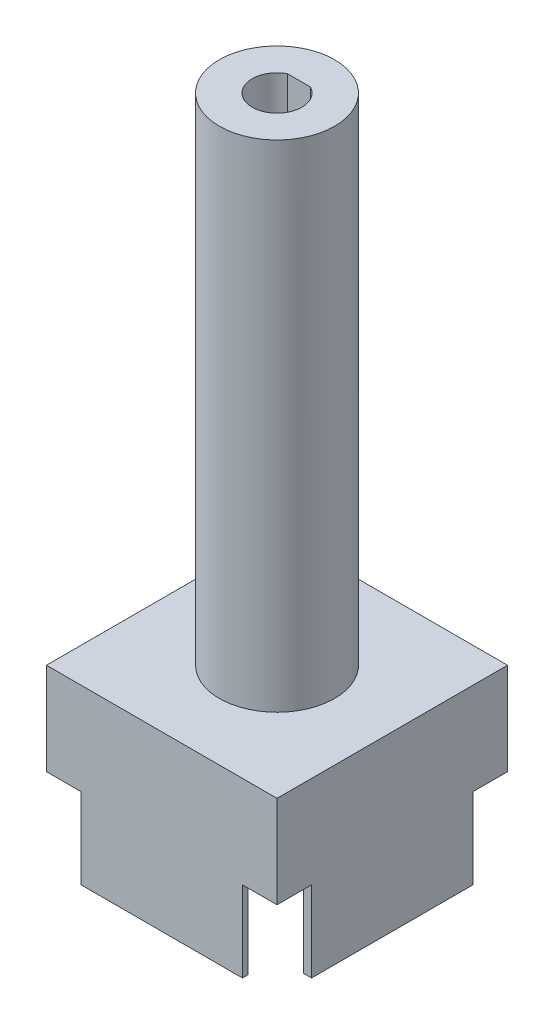
ISO-10303-21;
HEADER;
FILE_DESCRIPTION(('STEP AP214'),'2;1');
FILE_NAME('part.step','',(''),(''),'','','');
FILE_SCHEMA(('AUTOMOTIVE_DESIGN { 1 0 10303 214 1 1 1 1 }'));
ENDSEC;
DATA;
#1=APPLICATION_CONTEXT('core data for automotive mechanical design processes');
#2=APPLICATION_PROTOCOL_DEFINITION('international standard','automotive_design',2000,#1);
#3=PRODUCT_CONTEXT('',#1,'mechanical');
#4=PRODUCT('Part','Part','',(#3));
#5=PRODUCT_RELATED_PRODUCT_CATEGORY('part','',(#4));
#6=PRODUCT_DEFINITION_FORMATION('','',#4);
#7=PRODUCT_DEFINITION_CONTEXT('part definition',#1,'design');
#8=PRODUCT_DEFINITION('design','',#6,#7);
#9=PRODUCT_DEFINITION_SHAPE('','',#8);
#10=(LENGTH_UNIT() NAMED_UNIT(*) SI_UNIT(.MILLI.,.METRE.));
#11=(NAMED_UNIT(*) PLANE_ANGLE_UNIT() SI_UNIT($,.RADIAN.));
#12=(NAMED_UNIT(*) SI_UNIT($,.STERADIAN.) SOLID_ANGLE_UNIT());
#13=UNCERTAINTY_MEASURE_WITH_UNIT(LENGTH_MEASURE(1.E-05),#10,'distance_accuracy_value','');
#14=(GEOMETRIC_REPRESENTATION_CONTEXT(3) GLOBAL_UNCERTAINTY_ASSIGNED_CONTEXT((#13)) GLOBAL_UNIT_ASSIGNED_CONTEXT((#10,
#11,#12)) REPRESENTATION_CONTEXT('',''));
#15=CARTESIAN_POINT('',(0.,0.,0.));
#16=DIRECTION('',(0.,0.,1.));
#17=DIRECTION('',(1.,0.,0.));
#18=AXIS2_PLACEMENT_3D('',#15,#16,#17);
#19=CARTESIAN_POINT('',(0.,0.,0.));
#20=DIRECTION('',(0.,-1.,0.));
#21=DIRECTION('',(0.,0.,-1.));
#22=AXIS2_PLACEMENT_3D('',#19,#20,#21);
#23=PLANE('',#22);
#24=DIRECTION('',(-1.,0.,0.));
#25=VECTOR('',#24,1.);
#26=CARTESIAN_POINT('',(0.,0.,-17.));
#27=LINE('',#26,#25);
#28=CARTESIAN_POINT('',(20.,0.,-17.));
#29=VERTEX_POINT('',#28);
#30=CARTESIAN_POINT('',(19.3,0.,-17.));
#31=VERTEX_POINT('',#30);
#32=EDGE_CURVE('E276',#29,#31,#27,.T.);
#33=ORIENTED_EDGE('',*,*,#32,.F.);
#34=DIRECTION('',(0.,0.,-1.));
#35=VECTOR('',#34,1.);
#36=CARTESIAN_POINT('',(20.,0.,0.));
#37=LINE('',#36,#35);
#38=CARTESIAN_POINT('',(20.,0.,-3.));
#39=VERTEX_POINT('',#38);
#40=EDGE_CURVE('E349',#39,#29,#37,.T.);
#41=ORIENTED_EDGE('',*,*,#40,.F.);
#42=DIRECTION('',(1.,0.,0.));
#43=VECTOR('',#42,1.);
#44=CARTESIAN_POINT('',(0.,0.,-3.));
#45=LINE('',#44,#43);
#46=CARTESIAN_POINT('',(19.3,0.,-3.));
#47=VERTEX_POINT('',#46);
#48=EDGE_CURVE('E264',#47,#39,#45,.T.);
#49=ORIENTED_EDGE('',*,*,#48,.F.);
#50=DIRECTION('',(0.,0.,-1.));
#51=VECTOR('',#50,1.);
#52=CARTESIAN_POINT('',(19.3,0.,-0.5));
#53=LINE('',#52,#51);
#54=EDGE_CURVE('E342',#47,#31,#53,.T.);
#55=ORIENTED_EDGE('',*,*,#54,.T.);
#56=EDGE_LOOP('',(#33,#41,#49,#55));
#57=FACE_BOUND('',#56,.T.);
#58=ADVANCED_FACE('F33',(#57),#23,.T.);
#59=DIRECTION('',(0.,0.,-1.));
#60=VECTOR('',#59,1.);
#61=CARTESIAN_POINT('',(17.,0.,0.));
#62=LINE('',#61,#60);
#63=CARTESIAN_POINT('',(17.,0.,0.));
#64=VERTEX_POINT('',#63);
#65=CARTESIAN_POINT('',(17.,0.,-0.5));
#66=VERTEX_POINT('',#65);
#67=EDGE_CURVE('E268',#64,#66,#62,.T.);
#68=ORIENTED_EDGE('',*,*,#67,.F.);
#69=DIRECTION('',(1.,0.,0.));
#70=VECTOR('',#69,1.);
#71=CARTESIAN_POINT('',(0.,0.,0.));
#72=LINE('',#71,#70);
#73=CARTESIAN_POINT('',(3.,0.,0.));
#74=VERTEX_POINT('',#73);
#75=EDGE_CURVE('E347',#74,#64,#72,.T.);
#76=ORIENTED_EDGE('',*,*,#75,.F.);
#77=DIRECTION('',(0.,0.,1.));
#78=VECTOR('',#77,1.);
#79=CARTESIAN_POINT('',(3.,0.,0.));
#80=LINE('',#79,#78);
#81=CARTESIAN_POINT('',(3.,0.,-0.5));
#82=VERTEX_POINT('',#81);
#83=EDGE_CURVE('E256',#82,#74,#80,.T.);
#84=ORIENTED_EDGE('',*,*,#83,.F.);
#85=DIRECTION('',(1.,0.,0.));
#86=VECTOR('',#85,1.);
#87=CARTESIAN_POINT('',(0.5,0.,-0.5));
#88=LINE('',#87,#86);
#89=EDGE_CURVE('E339',#82,#66,#88,.T.);
#90=ORIENTED_EDGE('',*,*,#89,.T.);
#91=EDGE_LOOP('',(#68,#76,#84,#90));
#92=FACE_BOUND('',#91,.T.);
#93=ADVANCED_FACE('F394',(#92),#23,.T.);
#94=DIRECTION('',(1.,0.,0.));
#95=VECTOR('',#94,1.);
#96=CARTESIAN_POINT('',(0.,0.,-3.));
#97=LINE('',#96,#95);
#98=CARTESIAN_POINT('',(0.,0.,-3.));
#99=VERTEX_POINT('',#98);
#100=CARTESIAN_POINT('',(0.5,0.,-3.));
#101=VERTEX_POINT('',#100);
#102=EDGE_CURVE('E260',#99,#101,#97,.T.);
#103=ORIENTED_EDGE('',*,*,#102,.F.);
#104=DIRECTION('',(0.,0.,1.));
#105=VECTOR('',#104,1.);
#106=CARTESIAN_POINT('',(0.,0.,0.));
#107=LINE('',#106,#105);
#108=CARTESIAN_POINT('',(0.,0.,-17.));
#109=VERTEX_POINT('',#108);
#110=EDGE_CURVE('E336',#109,#99,#107,.T.);
#111=ORIENTED_EDGE('',*,*,#110,.F.);
#112=DIRECTION('',(-1.,0.,0.));
#113=VECTOR('',#112,1.);
#114=CARTESIAN_POINT('',(0.,0.,-17.));
#115=LINE('',#114,#113);
#116=CARTESIAN_POINT('',(0.5,0.,-17.));
#117=VERTEX_POINT('',#116);
#118=EDGE_CURVE('E295',#117,#109,#115,.T.);
#119=ORIENTED_EDGE('',*,*,#118,.F.);
#120=DIRECTION('',(0.,0.,1.));
#121=VECTOR('',#120,1.);
#122=CARTESIAN_POINT('',(0.5,0.,-0.5));
#123=LINE('',#122,#121);
#124=EDGE_CURVE('E324',#117,#101,#123,.T.);
#125=ORIENTED_EDGE('',*,*,#124,.T.);
#126=EDGE_LOOP('',(#103,#111,#119,#125));
#127=FACE_BOUND('',#126,.T.);
#128=ADVANCED_FACE('F370',(#127),#23,.T.);
#129=DIRECTION('',(0.,0.,-1.));
#130=VECTOR('',#129,1.);
#131=CARTESIAN_POINT('',(17.,0.,0.));
#132=LINE('',#131,#130);
#133=CARTESIAN_POINT('',(17.,0.,-19.5));
#134=VERTEX_POINT('',#133);
#135=CARTESIAN_POINT('',(17.,0.,-20.));
#136=VERTEX_POINT('',#135);
#137=EDGE_CURVE('E272',#134,#136,#132,.T.);
#138=ORIENTED_EDGE('',*,*,#137,.F.);
#139=DIRECTION('',(-1.,0.,0.));
#140=VECTOR('',#139,1.);
#141=CARTESIAN_POINT('',(0.5,0.,-19.5));
#142=LINE('',#141,#140);
#143=CARTESIAN_POINT('',(3.,0.,-19.5));
#144=VERTEX_POINT('',#143);
#145=EDGE_CURVE('E329',#134,#144,#142,.T.);
#146=ORIENTED_EDGE('',*,*,#145,.T.);
#147=DIRECTION('',(0.,0.,1.));
#148=VECTOR('',#147,1.);
#149=CARTESIAN_POINT('',(3.,0.,0.));
#150=LINE('',#149,#148);
#151=CARTESIAN_POINT('',(3.,0.,-20.));
#152=VERTEX_POINT('',#151);
#153=EDGE_CURVE('E300',#152,#144,#150,.T.);
#154=ORIENTED_EDGE('',*,*,#153,.F.);
#155=DIRECTION('',(-1.,0.,0.));
#156=VECTOR('',#155,1.);
#157=CARTESIAN_POINT('',(0.,0.,-20.));
#158=LINE('',#157,#156);
#159=EDGE_CURVE('E216',#136,#152,#158,.T.);
#160=ORIENTED_EDGE('',*,*,#159,.F.);
#161=EDGE_LOOP('',(#138,#146,#154,#160));
#162=FACE_BOUND('',#161,.T.);
#163=ADVANCED_FACE('F359',(#162),#23,.T.);
#164=CARTESIAN_POINT('',(0.,7.,0.));
#165=DIRECTION('',(1.,0.,0.));
#166=DIRECTION('',(0.,0.,-1.));
#167=AXIS2_PLACEMENT_3D('',#164,#165,#166);
#168=PLANE('',#167);
#169=ORIENTED_EDGE('',*,*,#110,.T.);
#170=DIRECTION('',(0.,1.,0.));
#171=VECTOR('',#170,1.);
#172=CARTESIAN_POINT('',(0.,-3.,-3.));
#173=LINE('',#172,#171);
#174=CARTESIAN_POINT('',(0.,7.,-3.));
#175=VERTEX_POINT('',#174);
#176=EDGE_CURVE('E238',#99,#175,#173,.T.);
#177=ORIENTED_EDGE('',*,*,#176,.T.);
#178=DIRECTION('',(0.,0.,1.));
#179=VECTOR('',#178,1.);
#180=CARTESIAN_POINT('',(0.,7.,0.));
#181=LINE('',#180,#179);
#182=CARTESIAN_POINT('',(0.,7.,0.));
#183=VERTEX_POINT('',#182);
#184=EDGE_CURVE('E237',#175,#183,#181,.T.);
#185=ORIENTED_EDGE('',*,*,#184,.T.);
#186=DIRECTION('',(0.,-1.,0.));
#187=VECTOR('',#186,1.);
#188=CARTESIAN_POINT('',(0.,7.,0.));
#189=LINE('',#188,#187);
#190=CARTESIAN_POINT('',(0.,15.,0.));
#191=VERTEX_POINT('',#190);
#192=EDGE_CURVE('E41',#191,#183,#189,.T.);
#193=ORIENTED_EDGE('',*,*,#192,.F.);
#194=DIRECTION('',(0.,0.,1.));
#195=VECTOR('',#194,1.);
#196=CARTESIAN_POINT('',(0.,15.,0.));
#197=LINE('',#196,#195);
#198=CARTESIAN_POINT('',(0.,15.,-20.));
#199=VERTEX_POINT('',#198);
#200=EDGE_CURVE('E234',#199,#191,#197,.T.);
#201=ORIENTED_EDGE('',*,*,#200,.F.);
#202=DIRECTION('',(0.,-1.,0.));
#203=VECTOR('',#202,1.);
#204=CARTESIAN_POINT('',(0.,7.,-20.));
#205=LINE('',#204,#203);
#206=CARTESIAN_POINT('',(0.,7.,-20.));
#207=VERTEX_POINT('',#206);
#208=EDGE_CURVE('E211',#199,#207,#205,.T.);
#209=ORIENTED_EDGE('',*,*,#208,.T.);
#210=DIRECTION('',(0.,0.,1.));
#211=VECTOR('',#210,1.);
#212=CARTESIAN_POINT('',(0.,7.,-20.));
#213=LINE('',#212,#211);
#214=CARTESIAN_POINT('',(0.,7.,-17.));
#215=VERTEX_POINT('',#214);
#216=EDGE_CURVE('E278',#207,#215,#213,.T.);
#217=ORIENTED_EDGE('',*,*,#216,.T.);
#218=DIRECTION('',(0.,1.,0.));
#219=VECTOR('',#218,1.);
#220=CARTESIAN_POINT('',(0.,-3.,-17.));
#221=LINE('',#220,#219);
#222=EDGE_CURVE('E288',#109,#215,#221,.T.);
#223=ORIENTED_EDGE('',*,*,#222,.F.);
#224=EDGE_LOOP('',(#169,#177,#185,#193,#201,#209,#217,#223));
#225=FACE_BOUND('',#224,.T.);
#226=ADVANCED_FACE('F35',(#225),#168,.F.);
#227=CARTESIAN_POINT('',(0.,7.,0.));
#228=DIRECTION('',(0.,0.,-1.));
#229=DIRECTION('',(-1.,0.,0.));
#230=AXIS2_PLACEMENT_3D('',#227,#228,#229);
#231=PLANE('',#230);
#232=ORIENTED_EDGE('',*,*,#75,.T.);
#233=DIRECTION('',(0.,1.,0.));
#234=VECTOR('',#233,1.);
#235=CARTESIAN_POINT('',(17.,-3.,0.));
#236=LINE('',#235,#234);
#237=CARTESIAN_POINT('',(17.,7.,0.));
#238=VERTEX_POINT('',#237);
#239=EDGE_CURVE('E204',#64,#238,#236,.T.);
#240=ORIENTED_EDGE('',*,*,#239,.T.);
#241=DIRECTION('',(1.,0.,0.));
#242=VECTOR('',#241,1.);
#243=CARTESIAN_POINT('',(20.,7.,0.));
#244=LINE('',#243,#242);
#245=CARTESIAN_POINT('',(20.,7.,0.));
#246=VERTEX_POINT('',#245);
#247=EDGE_CURVE('E644',#238,#246,#244,.T.);
#248=ORIENTED_EDGE('',*,*,#247,.T.);
#249=DIRECTION('',(0.,-1.,0.));
#250=VECTOR('',#249,1.);
#251=CARTESIAN_POINT('',(20.,7.,0.));
#252=LINE('',#251,#250);
#253=CARTESIAN_POINT('',(20.,15.,0.));
#254=VERTEX_POINT('',#253);
#255=EDGE_CURVE('E210',#254,#246,#252,.T.);
#256=ORIENTED_EDGE('',*,*,#255,.F.);
#257=DIRECTION('',(1.,0.,0.));
#258=VECTOR('',#257,1.);
#259=CARTESIAN_POINT('',(0.,15.,0.));
#260=LINE('',#259,#258);
#261=EDGE_CURVE('E228',#191,#254,#260,.T.);
#262=ORIENTED_EDGE('',*,*,#261,.F.);
#263=ORIENTED_EDGE('',*,*,#192,.T.);
#264=DIRECTION('',(1.,0.,0.));
#265=VECTOR('',#264,1.);
#266=CARTESIAN_POINT('',(0.,7.,0.));
#267=LINE('',#266,#265);
#268=CARTESIAN_POINT('',(3.,7.,0.));
#269=VERTEX_POINT('',#268);
#270=EDGE_CURVE('E226',#183,#269,#267,.T.);
#271=ORIENTED_EDGE('',*,*,#270,.T.);
#272=DIRECTION('',(0.,1.,0.));
#273=VECTOR('',#272,1.);
#274=CARTESIAN_POINT('',(3.,-3.,0.));
#275=LINE('',#274,#273);
#276=EDGE_CURVE('E250',#74,#269,#275,.T.);
#277=ORIENTED_EDGE('',*,*,#276,.F.);
#278=EDGE_LOOP('',(#232,#240,#248,#256,#262,#263,#271,#277));
#279=FACE_BOUND('',#278,.T.);
#280=ADVANCED_FACE('F224',(#279),#231,.F.);
#281=CARTESIAN_POINT('',(20.,7.,0.));
#282=DIRECTION('',(-1.,0.,0.));
#283=DIRECTION('',(0.,0.,1.));
#284=AXIS2_PLACEMENT_3D('',#281,#282,#283);
#285=PLANE('',#284);
#286=ORIENTED_EDGE('',*,*,#40,.T.);
#287=DIRECTION('',(0.,1.,0.));
#288=VECTOR('',#287,1.);
#289=CARTESIAN_POINT('',(20.,-3.,-17.));
#290=LINE('',#289,#288);
#291=CARTESIAN_POINT('',(20.,7.,-17.));
#292=VERTEX_POINT('',#291);
#293=EDGE_CURVE('E203',#29,#292,#290,.T.);
#294=ORIENTED_EDGE('',*,*,#293,.T.);
#295=DIRECTION('',(0.,0.,-1.));
#296=VECTOR('',#295,1.);
#297=CARTESIAN_POINT('',(20.,7.,-20.));
#298=LINE('',#297,#296);
#299=CARTESIAN_POINT('',(20.,7.,-20.));
#300=VERTEX_POINT('',#299);
#301=EDGE_CURVE('E190',#292,#300,#298,.T.);
#302=ORIENTED_EDGE('',*,*,#301,.T.);
#303=DIRECTION('',(0.,-1.,0.));
#304=VECTOR('',#303,1.);
#305=CARTESIAN_POINT('',(20.,7.,-20.));
#306=LINE('',#305,#304);
#307=CARTESIAN_POINT('',(20.,15.,-20.));
#308=VERTEX_POINT('',#307);
#309=EDGE_CURVE('E201',#308,#300,#306,.T.);
#310=ORIENTED_EDGE('',*,*,#309,.F.);
#311=DIRECTION('',(0.,0.,-1.));
#312=VECTOR('',#311,1.);
#313=CARTESIAN_POINT('',(20.,15.,0.));
#314=LINE('',#313,#312);
#315=EDGE_CURVE('E321',#254,#308,#314,.T.);
#316=ORIENTED_EDGE('',*,*,#315,.F.);
#317=ORIENTED_EDGE('',*,*,#255,.T.);
#318=DIRECTION('',(0.,0.,-1.));
#319=VECTOR('',#318,1.);
#320=CARTESIAN_POINT('',(20.,7.,0.));
#321=LINE('',#320,#319);
#322=CARTESIAN_POINT('',(20.,7.,-3.));
#323=VERTEX_POINT('',#322);
#324=EDGE_CURVE('E252',#246,#323,#321,.T.);
#325=ORIENTED_EDGE('',*,*,#324,.T.);
#326=DIRECTION('',(0.,1.,0.));
#327=VECTOR('',#326,1.);
#328=CARTESIAN_POINT('',(20.,-3.,-3.));
#329=LINE('',#328,#327);
#330=EDGE_CURVE('E244',#39,#323,#329,.T.);
#331=ORIENTED_EDGE('',*,*,#330,.F.);
#332=EDGE_LOOP('',(#286,#294,#302,#310,#316,#317,#325,#331));
#333=FACE_BOUND('',#332,.T.);
#334=ADVANCED_FACE('F199',(#333),#285,.F.);
#335=CARTESIAN_POINT('',(0.,7.,-20.));
#336=DIRECTION('',(0.,0.,1.));
#337=DIRECTION('',(1.,0.,0.));
#338=AXIS2_PLACEMENT_3D('',#335,#336,#337);
#339=PLANE('',#338);
#340=DIRECTION('',(-1.,0.,0.));
#341=VECTOR('',#340,1.);
#342=CARTESIAN_POINT('',(20.,7.,-20.));
#343=LINE('',#342,#341);
#344=CARTESIAN_POINT('',(17.,7.,-20.));
#345=VERTEX_POINT('',#344);
#346=EDGE_CURVE('E186',#300,#345,#343,.T.);
#347=ORIENTED_EDGE('',*,*,#346,.T.);
#348=DIRECTION('',(0.,1.,0.));
#349=VECTOR('',#348,1.);
#350=CARTESIAN_POINT('',(17.,-3.,-20.));
#351=LINE('',#350,#349);
#352=EDGE_CURVE('E352',#136,#345,#351,.T.);
#353=ORIENTED_EDGE('',*,*,#352,.F.);
#354=ORIENTED_EDGE('',*,*,#159,.T.);
#355=DIRECTION('',(0.,1.,0.));
#356=VECTOR('',#355,1.);
#357=CARTESIAN_POINT('',(3.,-3.,-20.));
#358=LINE('',#357,#356);
#359=CARTESIAN_POINT('',(3.,7.,-20.));
#360=VERTEX_POINT('',#359);
#361=EDGE_CURVE('E289',#152,#360,#358,.T.);
#362=ORIENTED_EDGE('',*,*,#361,.T.);
#363=DIRECTION('',(-1.,0.,0.));
#364=VECTOR('',#363,1.);
#365=CARTESIAN_POINT('',(0.,7.,-20.));
#366=LINE('',#365,#364);
#367=EDGE_CURVE('E285',#360,#207,#366,.T.);
#368=ORIENTED_EDGE('',*,*,#367,.T.);
#369=ORIENTED_EDGE('',*,*,#208,.F.);
#370=DIRECTION('',(-1.,0.,0.));
#371=VECTOR('',#370,1.);
#372=CARTESIAN_POINT('',(0.,15.,-20.));
#373=LINE('',#372,#371);
#374=EDGE_CURVE('E209',#308,#199,#373,.T.);
#375=ORIENTED_EDGE('',*,*,#374,.F.);
#376=ORIENTED_EDGE('',*,*,#309,.T.);
#377=EDGE_LOOP('',(#347,#353,#354,#362,#368,#369,#375,#376));
#378=FACE_BOUND('',#377,.T.);
#379=ADVANCED_FACE('F207',(#378),#339,.F.);
#380=CARTESIAN_POINT('',(0.5,7.,-0.5));
#381=DIRECTION('',(1.,0.,0.));
#382=DIRECTION('',(0.,0.,-1.));
#383=AXIS2_PLACEMENT_3D('',#380,#381,#382);
#384=PLANE('',#383);
#385=DIRECTION('',(0.,1.,0.));
#386=VECTOR('',#385,1.);
#387=CARTESIAN_POINT('',(0.5,7.,-3.));
#388=LINE('',#387,#386);
#389=CARTESIAN_POINT('',(0.5,7.,-3.));
#390=VERTEX_POINT('',#389);
#391=EDGE_CURVE('E258',#101,#390,#388,.T.);
#392=ORIENTED_EDGE('',*,*,#391,.F.);
#393=ORIENTED_EDGE('',*,*,#124,.F.);
#394=DIRECTION('',(0.,-1.,0.));
#395=VECTOR('',#394,1.);
#396=CARTESIAN_POINT('',(0.5,7.,-17.));
#397=LINE('',#396,#395);
#398=CARTESIAN_POINT('',(0.5,7.,-17.));
#399=VERTEX_POINT('',#398);
#400=EDGE_CURVE('E292',#399,#117,#397,.T.);
#401=ORIENTED_EDGE('',*,*,#400,.F.);
#402=DIRECTION('',(0.,0.,1.));
#403=VECTOR('',#402,1.);
#404=CARTESIAN_POINT('',(0.5,7.,-0.5));
#405=LINE('',#404,#403);
#406=EDGE_CURVE('E325',#399,#390,#405,.T.);
#407=ORIENTED_EDGE('',*,*,#406,.T.);
#408=EDGE_LOOP('',(#392,#393,#401,#407));
#409=FACE_BOUND('',#408,.T.);
#410=ADVANCED_FACE('F376',(#409),#384,.T.);
#411=CARTESIAN_POINT('',(0.5,7.,-0.5));
#412=DIRECTION('',(0.,0.,-1.));
#413=DIRECTION('',(-1.,0.,0.));
#414=AXIS2_PLACEMENT_3D('',#411,#412,#413);
#415=PLANE('',#414);
#416=DIRECTION('',(0.,1.,0.));
#417=VECTOR('',#416,1.);
#418=CARTESIAN_POINT('',(17.,7.,-0.5));
#419=LINE('',#418,#417);
#420=CARTESIAN_POINT('',(17.,7.,-0.5));
#421=VERTEX_POINT('',#420);
#422=EDGE_CURVE('E266',#66,#421,#419,.T.);
#423=ORIENTED_EDGE('',*,*,#422,.F.);
#424=ORIENTED_EDGE('',*,*,#89,.F.);
#425=DIRECTION('',(0.,-1.,0.));
#426=VECTOR('',#425,1.);
#427=CARTESIAN_POINT('',(3.,7.,-0.5));
#428=LINE('',#427,#426);
#429=CARTESIAN_POINT('',(3.,7.,-0.5));
#430=VERTEX_POINT('',#429);
#431=EDGE_CURVE('E254',#430,#82,#428,.T.);
#432=ORIENTED_EDGE('',*,*,#431,.F.);
#433=DIRECTION('',(1.,0.,0.));
#434=VECTOR('',#433,1.);
#435=CARTESIAN_POINT('',(0.5,7.,-0.5));
#436=LINE('',#435,#434);
#437=EDGE_CURVE('E328',#430,#421,#436,.T.);
#438=ORIENTED_EDGE('',*,*,#437,.T.);
#439=EDGE_LOOP('',(#423,#424,#432,#438));
#440=FACE_BOUND('',#439,.T.);
#441=ADVANCED_FACE('F499',(#440),#415,.T.);
#442=CARTESIAN_POINT('',(19.3,7.,-0.5));
#443=DIRECTION('',(-1.,0.,0.));
#444=DIRECTION('',(0.,0.,1.));
#445=AXIS2_PLACEMENT_3D('',#442,#443,#444);
#446=PLANE('',#445);
#447=DIRECTION('',(0.,1.,0.));
#448=VECTOR('',#447,1.);
#449=CARTESIAN_POINT('',(19.3,7.,-17.));
#450=LINE('',#449,#448);
#451=CARTESIAN_POINT('',(19.3,7.,-17.));
#452=VERTEX_POINT('',#451);
#453=EDGE_CURVE('E274',#31,#452,#450,.T.);
#454=ORIENTED_EDGE('',*,*,#453,.F.);
#455=ORIENTED_EDGE('',*,*,#54,.F.);
#456=DIRECTION('',(0.,-1.,0.));
#457=VECTOR('',#456,1.);
#458=CARTESIAN_POINT('',(19.3,7.,-3.));
#459=LINE('',#458,#457);
#460=CARTESIAN_POINT('',(19.3,7.,-3.));
#461=VERTEX_POINT('',#460);
#462=EDGE_CURVE('E262',#461,#47,#459,.T.);
#463=ORIENTED_EDGE('',*,*,#462,.F.);
#464=DIRECTION('',(0.,0.,-1.));
#465=VECTOR('',#464,1.);
#466=CARTESIAN_POINT('',(19.3,7.,-0.5));
#467=LINE('',#466,#465);
#468=EDGE_CURVE('E332',#461,#452,#467,.T.);
#469=ORIENTED_EDGE('',*,*,#468,.T.);
#470=EDGE_LOOP('',(#454,#455,#463,#469));
#471=FACE_BOUND('',#470,.T.);
#472=ADVANCED_FACE('F492',(#471),#446,.T.);
#473=CARTESIAN_POINT('',(0.5,7.,-19.5));
#474=DIRECTION('',(0.,0.,1.));
#475=DIRECTION('',(1.,0.,0.));
#476=AXIS2_PLACEMENT_3D('',#473,#474,#475);
#477=PLANE('',#476);
#478=DIRECTION('',(0.,-1.,0.));
#479=VECTOR('',#478,1.);
#480=CARTESIAN_POINT('',(17.,7.,-19.5));
#481=LINE('',#480,#479);
#482=CARTESIAN_POINT('',(17.,7.,-19.5));
#483=VERTEX_POINT('',#482);
#484=EDGE_CURVE('E270',#483,#134,#481,.T.);
#485=ORIENTED_EDGE('',*,*,#484,.F.);
#486=DIRECTION('',(-1.,0.,0.));
#487=VECTOR('',#486,1.);
#488=CARTESIAN_POINT('',(0.5,7.,-19.5));
#489=LINE('',#488,#487);
#490=CARTESIAN_POINT('',(3.,7.,-19.5));
#491=VERTEX_POINT('',#490);
#492=EDGE_CURVE('E48',#483,#491,#489,.T.);
#493=ORIENTED_EDGE('',*,*,#492,.T.);
#494=DIRECTION('',(0.,1.,0.));
#495=VECTOR('',#494,1.);
#496=CARTESIAN_POINT('',(3.,7.,-19.5));
#497=LINE('',#496,#495);
#498=EDGE_CURVE('E297',#144,#491,#497,.T.);
#499=ORIENTED_EDGE('',*,*,#498,.F.);
#500=ORIENTED_EDGE('',*,*,#145,.F.);
#501=EDGE_LOOP('',(#485,#493,#499,#500));
#502=FACE_BOUND('',#501,.T.);
#503=ADVANCED_FACE('F361',(#502),#477,.T.);
#504=CARTESIAN_POINT('',(0.,7.,0.));
#505=DIRECTION('',(0.,-1.,0.));
#506=DIRECTION('',(0.,0.,-1.));
#507=AXIS2_PLACEMENT_3D('',#504,#505,#506);
#508=PLANE('',#507);
#509=DIRECTION('',(1.,0.,0.));
#510=VECTOR('',#509,1.);
#511=CARTESIAN_POINT('',(20.,7.,-17.));
#512=LINE('',#511,#510);
#513=EDGE_CURVE('E659',#452,#292,#512,.T.);
#514=ORIENTED_EDGE('',*,*,#513,.F.);
#515=ORIENTED_EDGE('',*,*,#468,.F.);
#516=DIRECTION('',(-1.,0.,0.));
#517=VECTOR('',#516,1.);
#518=CARTESIAN_POINT('',(20.,7.,-3.));
#519=LINE('',#518,#517);
#520=EDGE_CURVE('E645',#323,#461,#519,.T.);
#521=ORIENTED_EDGE('',*,*,#520,.F.);
#522=ORIENTED_EDGE('',*,*,#324,.F.);
#523=ORIENTED_EDGE('',*,*,#247,.F.);
#524=DIRECTION('',(0.,0.,1.));
#525=VECTOR('',#524,1.);
#526=CARTESIAN_POINT('',(17.,7.,0.));
#527=LINE('',#526,#525);
#528=EDGE_CURVE('E642',#421,#238,#527,.T.);
#529=ORIENTED_EDGE('',*,*,#528,.F.);
#530=ORIENTED_EDGE('',*,*,#437,.F.);
#531=DIRECTION('',(0.,0.,-1.));
#532=VECTOR('',#531,1.);
#533=CARTESIAN_POINT('',(3.,7.,0.));
#534=LINE('',#533,#532);
#535=EDGE_CURVE('E241',#269,#430,#534,.T.);
#536=ORIENTED_EDGE('',*,*,#535,.F.);
#537=ORIENTED_EDGE('',*,*,#270,.F.);
#538=ORIENTED_EDGE('',*,*,#184,.F.);
#539=DIRECTION('',(-1.,0.,0.));
#540=VECTOR('',#539,1.);
#541=CARTESIAN_POINT('',(0.,7.,-3.));
#542=LINE('',#541,#540);
#543=EDGE_CURVE('E248',#390,#175,#542,.T.);
#544=ORIENTED_EDGE('',*,*,#543,.F.);
#545=ORIENTED_EDGE('',*,*,#406,.F.);
#546=DIRECTION('',(1.,0.,0.));
#547=VECTOR('',#546,1.);
#548=CARTESIAN_POINT('',(0.,7.,-17.));
#549=LINE('',#548,#547);
#550=EDGE_CURVE('E281',#215,#399,#549,.T.);
#551=ORIENTED_EDGE('',*,*,#550,.F.);
#552=ORIENTED_EDGE('',*,*,#216,.F.);
#553=ORIENTED_EDGE('',*,*,#367,.F.);
#554=DIRECTION('',(0.,0.,-1.));
#555=VECTOR('',#554,1.);
#556=CARTESIAN_POINT('',(3.,7.,-20.));
#557=LINE('',#556,#555);
#558=EDGE_CURVE('E283',#491,#360,#557,.T.);
#559=ORIENTED_EDGE('',*,*,#558,.F.);
#560=ORIENTED_EDGE('',*,*,#492,.F.);
#561=DIRECTION('',(0.,0.,1.));
#562=VECTOR('',#561,1.);
#563=CARTESIAN_POINT('',(17.,7.,-20.));
#564=LINE('',#563,#562);
#565=EDGE_CURVE('E192',#345,#483,#564,.T.);
#566=ORIENTED_EDGE('',*,*,#565,.F.);
#567=ORIENTED_EDGE('',*,*,#346,.F.);
#568=ORIENTED_EDGE('',*,*,#301,.F.);
#569=EDGE_LOOP('',(#514,#515,#521,#522,#523,#529,#530,#536,#537,#538,#544,#545,#551,#552,#553,
#559,#560,#566,#567,#568));
#570=FACE_BOUND('',#569,.T.);
#571=ADVANCED_FACE('F189',(#570),#508,.T.);
#572=CARTESIAN_POINT('',(0.,15.,0.));
#573=DIRECTION('',(0.,-1.,0.));
#574=DIRECTION('',(0.,0.,-1.));
#575=AXIS2_PLACEMENT_3D('',#572,#573,#574);
#576=PLANE('',#575);
#577=CARTESIAN_POINT('',(10.,15.,-10.));
#578=DIRECTION('',(0.,-1.,0.));
#579=DIRECTION('',(0.,0.,-1.));
#580=AXIS2_PLACEMENT_3D('',#577,#578,#579);
#581=CIRCLE('',#580,5.);
#582=CARTESIAN_POINT('',(10.,15.,-15.));
#583=VERTEX_POINT('',#582);
#584=EDGE_CURVE('E11',#583,#583,#581,.F.);
#585=ORIENTED_EDGE('',*,*,#584,.F.);
#586=EDGE_LOOP('',(#585));
#587=FACE_BOUND('',#586,.T.);
#588=ORIENTED_EDGE('',*,*,#200,.T.);
#589=ORIENTED_EDGE('',*,*,#261,.T.);
#590=ORIENTED_EDGE('',*,*,#315,.T.);
#591=ORIENTED_EDGE('',*,*,#374,.T.);
#592=EDGE_LOOP('',(#588,#589,#590,#591));
#593=FACE_BOUND('',#592,.T.);
#594=ADVANCED_FACE('F467',(#587,#593),#576,.F.);
#595=CARTESIAN_POINT('',(10.,58.,-10.));
#596=DIRECTION('',(0.,-1.,0.));
#597=DIRECTION('',(0.,0.,-1.));
#598=AXIS2_PLACEMENT_3D('',#595,#596,#597);
#599=CYLINDRICAL_SURFACE('',#598,5.);
#600=CARTESIAN_POINT('',(10.,58.,-10.));
#601=DIRECTION('',(0.,1.,0.));
#602=DIRECTION('',(0.,0.,1.));
#603=AXIS2_PLACEMENT_3D('',#600,#601,#602);
#604=CIRCLE('',#603,5.);
#605=CARTESIAN_POINT('',(10.,58.,-5.));
#606=VERTEX_POINT('',#605);
#607=EDGE_CURVE('E315',#606,#606,#604,.T.);
#608=ORIENTED_EDGE('',*,*,#607,.F.);
#609=EDGE_LOOP('',(#608));
#610=FACE_BOUND('',#609,.T.);
#611=ORIENTED_EDGE('',*,*,#584,.T.);
#612=EDGE_LOOP('',(#611));
#613=FACE_BOUND('',#612,.T.);
#614=ADVANCED_FACE('F457',(#610,#613),#599,.T.);
#615=CARTESIAN_POINT('',(10.,58.,-10.));
#616=DIRECTION('',(0.,1.,0.));
#617=DIRECTION('',(0.,0.,1.));
#618=AXIS2_PLACEMENT_3D('',#615,#616,#617);
#619=PLANE('',#618);
#620=CARTESIAN_POINT('',(10.,58.,-10.));
#621=DIRECTION('',(0.,1.,0.));
#622=DIRECTION('',(0.,0.,1.));
#623=AXIS2_PLACEMENT_3D('',#620,#621,#622);
#624=CIRCLE('',#623,2.15);
#625=CARTESIAN_POINT('',(8.99376941012509,58.,-11.9));
#626=VERTEX_POINT('',#625);
#627=CARTESIAN_POINT('',(11.0062305898749,58.,-11.9));
#628=VERTEX_POINT('',#627);
#629=EDGE_CURVE('E56',#626,#628,#624,.T.);
#630=ORIENTED_EDGE('',*,*,#629,.F.);
#631=DIRECTION('',(1.,0.,0.));
#632=VECTOR('',#631,1.);
#633=CARTESIAN_POINT('',(0.,58.,-11.9));
#634=LINE('',#633,#632);
#635=EDGE_CURVE('E307',#626,#628,#634,.T.);
#636=ORIENTED_EDGE('',*,*,#635,.T.);
#637=EDGE_LOOP('',(#630,#636));
#638=FACE_BOUND('',#637,.T.);
#639=ORIENTED_EDGE('',*,*,#607,.T.);
#640=EDGE_LOOP('',(#639));
#641=FACE_BOUND('',#640,.T.);
#642=ADVANCED_FACE('F448',(#638,#641),#619,.T.);
#643=CARTESIAN_POINT('',(10.,40.,-10.));
#644=DIRECTION('',(0.,1.,0.));
#645=DIRECTION('',(0.,0.,1.));
#646=AXIS2_PLACEMENT_3D('',#643,#644,#645);
#647=CYLINDRICAL_SURFACE('',#646,2.15);
#648=ORIENTED_EDGE('',*,*,#629,.T.);
#649=DIRECTION('',(0.,1.,0.));
#650=VECTOR('',#649,1.);
#651=CARTESIAN_POINT('',(11.0062305898749,40.,-11.9));
#652=LINE('',#651,#650);
#653=CARTESIAN_POINT('',(11.0062305898749,40.,-11.9));
#654=VERTEX_POINT('',#653);
#655=EDGE_CURVE('E309',#654,#628,#652,.T.);
#656=ORIENTED_EDGE('',*,*,#655,.F.);
#657=CARTESIAN_POINT('',(10.,40.,-10.));
#658=DIRECTION('',(0.,1.,0.));
#659=DIRECTION('',(0.,0.,1.));
#660=AXIS2_PLACEMENT_3D('',#657,#658,#659);
#661=CIRCLE('',#660,2.15);
#662=CARTESIAN_POINT('',(8.99376941012509,40.,-11.9));
#663=VERTEX_POINT('',#662);
#664=EDGE_CURVE('E303',#663,#654,#661,.T.);
#665=ORIENTED_EDGE('',*,*,#664,.F.);
#666=DIRECTION('',(0.,1.,0.));
#667=VECTOR('',#666,1.);
#668=CARTESIAN_POINT('',(8.99376941012509,40.,-11.9));
#669=LINE('',#668,#667);
#670=EDGE_CURVE('E313',#663,#626,#669,.T.);
#671=ORIENTED_EDGE('',*,*,#670,.T.);
#672=EDGE_LOOP('',(#648,#656,#665,#671));
#673=FACE_BOUND('',#672,.T.);
#674=ADVANCED_FACE('F438',(#673),#647,.F.);
#675=CARTESIAN_POINT('',(0.,40.,-11.9));
#676=DIRECTION('',(0.,0.,1.));
#677=DIRECTION('',(1.,0.,0.));
#678=AXIS2_PLACEMENT_3D('',#675,#676,#677);
#679=PLANE('',#678);
#680=ORIENTED_EDGE('',*,*,#635,.F.);
#681=ORIENTED_EDGE('',*,*,#670,.F.);
#682=DIRECTION('',(1.,0.,0.));
#683=VECTOR('',#682,1.);
#684=CARTESIAN_POINT('',(0.,40.,-11.9));
#685=LINE('',#684,#683);
#686=EDGE_CURVE('E306',#663,#654,#685,.T.);
#687=ORIENTED_EDGE('',*,*,#686,.T.);
#688=ORIENTED_EDGE('',*,*,#655,.T.);
#689=EDGE_LOOP('',(#680,#681,#687,#688));
#690=FACE_BOUND('',#689,.T.);
#691=ADVANCED_FACE('F429',(#690),#679,.T.);
#692=CARTESIAN_POINT('',(0.,40.,0.));
#693=DIRECTION('',(0.,1.,0.));
#694=DIRECTION('',(0.,0.,1.));
#695=AXIS2_PLACEMENT_3D('',#692,#693,#694);
#696=PLANE('',#695);
#697=ORIENTED_EDGE('',*,*,#664,.T.);
#698=ORIENTED_EDGE('',*,*,#686,.F.);
#699=EDGE_LOOP('',(#697,#698));
#700=FACE_BOUND('',#699,.T.);
#701=ADVANCED_FACE('F390',(#700),#696,.T.);
#702=CARTESIAN_POINT('',(3.,-3.,-20.));
#703=DIRECTION('',(1.,0.,0.));
#704=DIRECTION('',(0.,0.,-1.));
#705=AXIS2_PLACEMENT_3D('',#702,#703,#704);
#706=PLANE('',#705);
#707=ORIENTED_EDGE('',*,*,#153,.T.);
#708=ORIENTED_EDGE('',*,*,#498,.T.);
#709=ORIENTED_EDGE('',*,*,#558,.T.);
#710=ORIENTED_EDGE('',*,*,#361,.F.);
#711=EDGE_LOOP('',(#707,#708,#709,#710));
#712=FACE_BOUND('',#711,.T.);
#713=ADVANCED_FACE('F357',(#712),#706,.F.);
#714=CARTESIAN_POINT('',(0.,-3.,-17.));
#715=DIRECTION('',(0.,0.,1.));
#716=DIRECTION('',(1.,0.,0.));
#717=AXIS2_PLACEMENT_3D('',#714,#715,#716);
#718=PLANE('',#717);
#719=ORIENTED_EDGE('',*,*,#118,.T.);
#720=ORIENTED_EDGE('',*,*,#222,.T.);
#721=ORIENTED_EDGE('',*,*,#550,.T.);
#722=ORIENTED_EDGE('',*,*,#400,.T.);
#723=EDGE_LOOP('',(#719,#720,#721,#722));
#724=FACE_BOUND('',#723,.T.);
#725=ADVANCED_FACE('F379',(#724),#718,.F.);
#726=CARTESIAN_POINT('',(20.,-3.,-17.));
#727=DIRECTION('',(0.,0.,1.));
#728=DIRECTION('',(1.,0.,0.));
#729=AXIS2_PLACEMENT_3D('',#726,#727,#728);
#730=PLANE('',#729);
#731=ORIENTED_EDGE('',*,*,#32,.T.);
#732=ORIENTED_EDGE('',*,*,#453,.T.);
#733=ORIENTED_EDGE('',*,*,#513,.T.);
#734=ORIENTED_EDGE('',*,*,#293,.F.);
#735=EDGE_LOOP('',(#731,#732,#733,#734));
#736=FACE_BOUND('',#735,.T.);
#737=ADVANCED_FACE('F381',(#736),#730,.F.);
#738=CARTESIAN_POINT('',(17.,-3.,-20.));
#739=DIRECTION('',(-1.,0.,0.));
#740=DIRECTION('',(0.,0.,1.));
#741=AXIS2_PLACEMENT_3D('',#738,#739,#740);
#742=PLANE('',#741);
#743=ORIENTED_EDGE('',*,*,#137,.T.);
#744=ORIENTED_EDGE('',*,*,#352,.T.);
#745=ORIENTED_EDGE('',*,*,#565,.T.);
#746=ORIENTED_EDGE('',*,*,#484,.T.);
#747=EDGE_LOOP('',(#743,#744,#745,#746));
#748=FACE_BOUND('',#747,.T.);
#749=ADVANCED_FACE('F387',(#748),#742,.F.);
#750=CARTESIAN_POINT('',(17.,-3.,0.));
#751=DIRECTION('',(-1.,0.,0.));
#752=DIRECTION('',(0.,0.,1.));
#753=AXIS2_PLACEMENT_3D('',#750,#751,#752);
#754=PLANE('',#753);
#755=ORIENTED_EDGE('',*,*,#67,.T.);
#756=ORIENTED_EDGE('',*,*,#422,.T.);
#757=ORIENTED_EDGE('',*,*,#528,.T.);
#758=ORIENTED_EDGE('',*,*,#239,.F.);
#759=EDGE_LOOP('',(#755,#756,#757,#758));
#760=FACE_BOUND('',#759,.T.);
#761=ADVANCED_FACE('F590',(#760),#754,.F.);
#762=CARTESIAN_POINT('',(20.,-3.,-3.));
#763=DIRECTION('',(0.,0.,-1.));
#764=DIRECTION('',(-1.,0.,0.));
#765=AXIS2_PLACEMENT_3D('',#762,#763,#764);
#766=PLANE('',#765);
#767=ORIENTED_EDGE('',*,*,#48,.T.);
#768=ORIENTED_EDGE('',*,*,#330,.T.);
#769=ORIENTED_EDGE('',*,*,#520,.T.);
#770=ORIENTED_EDGE('',*,*,#462,.T.);
#771=EDGE_LOOP('',(#767,#768,#769,#770));
#772=FACE_BOUND('',#771,.T.);
#773=ADVANCED_FACE('F598',(#772),#766,.F.);
#774=CARTESIAN_POINT('',(0.,-3.,-3.));
#775=DIRECTION('',(0.,0.,-1.));
#776=DIRECTION('',(-1.,0.,0.));
#777=AXIS2_PLACEMENT_3D('',#774,#775,#776);
#778=PLANE('',#777);
#779=ORIENTED_EDGE('',*,*,#102,.T.);
#780=ORIENTED_EDGE('',*,*,#391,.T.);
#781=ORIENTED_EDGE('',*,*,#543,.T.);
#782=ORIENTED_EDGE('',*,*,#176,.F.);
#783=EDGE_LOOP('',(#779,#780,#781,#782));
#784=FACE_BOUND('',#783,.T.);
#785=ADVANCED_FACE('F374',(#784),#778,.F.);
#786=CARTESIAN_POINT('',(3.,-3.,0.));
#787=DIRECTION('',(1.,0.,0.));
#788=DIRECTION('',(0.,0.,-1.));
#789=AXIS2_PLACEMENT_3D('',#786,#787,#788);
#790=PLANE('',#789);
#791=ORIENTED_EDGE('',*,*,#83,.T.);
#792=ORIENTED_EDGE('',*,*,#276,.T.);
#793=ORIENTED_EDGE('',*,*,#535,.T.);
#794=ORIENTED_EDGE('',*,*,#431,.T.);
#795=EDGE_LOOP('',(#791,#792,#793,#794));
#796=FACE_BOUND('',#795,.T.);
#797=ADVANCED_FACE('F615',(#796),#790,.F.);
#798=CLOSED_SHELL('',(#58,#93,#128,#163,#226,#280,#334,#379,#410,#441,#472,#503,#571,#594,#614,
#642,#674,#691,#701,#713,#725,#737,#749,#761,#773,#785,#797));
#799=MANIFOLD_SOLID_BREP('B2',#798);
#800=ADVANCED_BREP_SHAPE_REPRESENTATION('',(#18,#799),#14);
#801=SHAPE_DEFINITION_REPRESENTATION(#9,#800);
ENDSEC;
END-ISO-10303-21;
